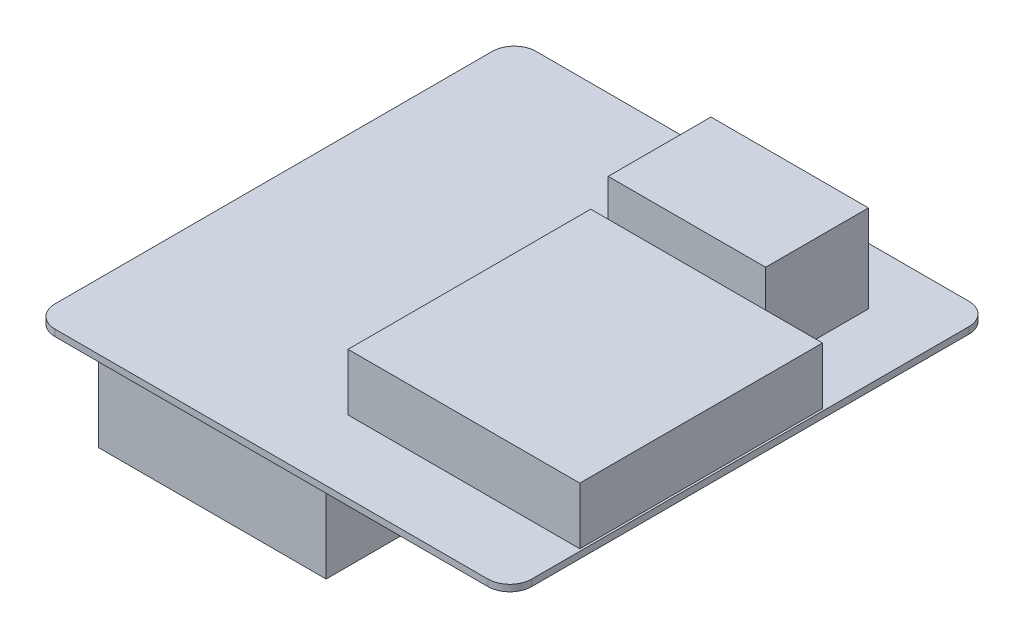
ISO-10303-21;
HEADER;
FILE_DESCRIPTION(('STEP AP214'),'2;1');
FILE_NAME('part.step','',(''),(''),'','','');
FILE_SCHEMA(('AUTOMOTIVE_DESIGN { 1 0 10303 214 1 1 1 1 }'));
ENDSEC;
DATA;
#1=APPLICATION_CONTEXT('core data for automotive mechanical design processes');
#2=APPLICATION_PROTOCOL_DEFINITION('international standard','automotive_design',2000,#1);
#3=PRODUCT_CONTEXT('',#1,'mechanical');
#4=PRODUCT('Part','Part','',(#3));
#5=PRODUCT_RELATED_PRODUCT_CATEGORY('part','',(#4));
#6=PRODUCT_DEFINITION_FORMATION('','',#4);
#7=PRODUCT_DEFINITION_CONTEXT('part definition',#1,'design');
#8=PRODUCT_DEFINITION('design','',#6,#7);
#9=PRODUCT_DEFINITION_SHAPE('','',#8);
#10=(LENGTH_UNIT() NAMED_UNIT(*) SI_UNIT(.MILLI.,.METRE.));
#11=(NAMED_UNIT(*) PLANE_ANGLE_UNIT() SI_UNIT($,.RADIAN.));
#12=(NAMED_UNIT(*) SI_UNIT($,.STERADIAN.) SOLID_ANGLE_UNIT());
#13=UNCERTAINTY_MEASURE_WITH_UNIT(LENGTH_MEASURE(1.E-05),#10,'distance_accuracy_value','');
#14=(GEOMETRIC_REPRESENTATION_CONTEXT(3) GLOBAL_UNCERTAINTY_ASSIGNED_CONTEXT((#13)) GLOBAL_UNIT_ASSIGNED_CONTEXT((#10,
#11,#12)) REPRESENTATION_CONTEXT('',''));
#15=CARTESIAN_POINT('',(0.,0.,0.));
#16=DIRECTION('',(0.,0.,1.));
#17=DIRECTION('',(1.,0.,0.));
#18=AXIS2_PLACEMENT_3D('',#15,#16,#17);
#19=CARTESIAN_POINT('',(0.,1.5,0.));
#20=DIRECTION('',(0.,-1.,0.));
#21=DIRECTION('',(0.,0.,-1.));
#22=AXIS2_PLACEMENT_3D('',#19,#20,#21);
#23=PLANE('',#22);
#24=DIRECTION('',(0.,0.,1.));
#25=VECTOR('',#24,1.);
#26=CARTESIAN_POINT('',(55.5,1.5,-16.5));
#27=LINE('',#26,#25);
#28=CARTESIAN_POINT('',(55.5,1.5,-72.));
#29=VERTEX_POINT('',#28);
#30=CARTESIAN_POINT('',(55.5,1.5,-16.5));
#31=VERTEX_POINT('',#30);
#32=EDGE_CURVE('E193',#29,#31,#27,.T.);
#33=ORIENTED_EDGE('',*,*,#32,.F.);
#34=DIRECTION('',(-1.,0.,0.));
#35=VECTOR('',#34,1.);
#36=CARTESIAN_POINT('',(55.5,1.5,-72.));
#37=LINE('',#36,#35);
#38=CARTESIAN_POINT('',(108.5,1.5,-72.));
#39=VERTEX_POINT('',#38);
#40=EDGE_CURVE('E206',#39,#29,#37,.T.);
#41=ORIENTED_EDGE('',*,*,#40,.F.);
#42=DIRECTION('',(0.,0.,-1.));
#43=VECTOR('',#42,1.);
#44=CARTESIAN_POINT('',(108.5,1.5,-16.5));
#45=LINE('',#44,#43);
#46=CARTESIAN_POINT('',(108.5,1.5,-16.5));
#47=VERTEX_POINT('',#46);
#48=EDGE_CURVE('E215',#47,#39,#45,.T.);
#49=ORIENTED_EDGE('',*,*,#48,.F.);
#50=DIRECTION('',(1.,0.,0.));
#51=VECTOR('',#50,1.);
#52=CARTESIAN_POINT('',(55.5,1.5,-16.5));
#53=LINE('',#52,#51);
#54=EDGE_CURVE('E196',#31,#47,#53,.T.);
#55=ORIENTED_EDGE('',*,*,#54,.F.);
#56=EDGE_LOOP('',(#33,#41,#49,#55));
#57=FACE_BOUND('',#56,.T.);
#58=DIRECTION('',(1.,0.,0.));
#59=VECTOR('',#58,1.);
#60=CARTESIAN_POINT('',(0.,1.5,0.));
#61=LINE('',#60,#59);
#62=CARTESIAN_POINT('',(5.,1.5,0.));
#63=VERTEX_POINT('',#62);
#64=CARTESIAN_POINT('',(104.,1.5,0.));
#65=VERTEX_POINT('',#64);
#66=EDGE_CURVE('E264',#63,#65,#61,.T.);
#67=ORIENTED_EDGE('',*,*,#66,.T.);
#68=CARTESIAN_POINT('',(104.,1.5,-5.));
#69=DIRECTION('',(0.,-1.,0.));
#70=DIRECTION('',(0.,0.,-1.));
#71=AXIS2_PLACEMENT_3D('',#68,#69,#70);
#72=CIRCLE('',#71,5.);
#73=CARTESIAN_POINT('',(109.,1.5,-5.));
#74=VERTEX_POINT('',#73);
#75=EDGE_CURVE('E308',#65,#74,#72,.F.);
#76=ORIENTED_EDGE('',*,*,#75,.T.);
#77=DIRECTION('',(0.,0.,-1.));
#78=VECTOR('',#77,1.);
#79=CARTESIAN_POINT('',(109.,1.5,0.));
#80=LINE('',#79,#78);
#81=CARTESIAN_POINT('',(109.,1.5,-105.));
#82=VERTEX_POINT('',#81);
#83=EDGE_CURVE('E268',#74,#82,#80,.T.);
#84=ORIENTED_EDGE('',*,*,#83,.T.);
#85=CARTESIAN_POINT('',(104.,1.5,-105.));
#86=DIRECTION('',(0.,-1.,0.));
#87=DIRECTION('',(0.,0.,-1.));
#88=AXIS2_PLACEMENT_3D('',#85,#86,#87);
#89=CIRCLE('',#88,5.);
#90=CARTESIAN_POINT('',(104.,1.5,-110.));
#91=VERTEX_POINT('',#90);
#92=EDGE_CURVE('E306',#82,#91,#89,.F.);
#93=ORIENTED_EDGE('',*,*,#92,.T.);
#94=DIRECTION('',(-1.,0.,0.));
#95=VECTOR('',#94,1.);
#96=CARTESIAN_POINT('',(0.,1.5,-110.));
#97=LINE('',#96,#95);
#98=CARTESIAN_POINT('',(5.,1.5,-110.));
#99=VERTEX_POINT('',#98);
#100=EDGE_CURVE('E271',#91,#99,#97,.T.);
#101=ORIENTED_EDGE('',*,*,#100,.T.);
#102=CARTESIAN_POINT('',(5.,1.5,-105.));
#103=DIRECTION('',(0.,-1.,0.));
#104=DIRECTION('',(0.,0.,-1.));
#105=AXIS2_PLACEMENT_3D('',#102,#103,#104);
#106=CIRCLE('',#105,5.);
#107=CARTESIAN_POINT('',(0.,1.5,-105.));
#108=VERTEX_POINT('',#107);
#109=EDGE_CURVE('E304',#99,#108,#106,.F.);
#110=ORIENTED_EDGE('',*,*,#109,.T.);
#111=DIRECTION('',(0.,0.,1.));
#112=VECTOR('',#111,1.);
#113=CARTESIAN_POINT('',(0.,1.5,0.));
#114=LINE('',#113,#112);
#115=CARTESIAN_POINT('',(0.,1.5,-5.));
#116=VERTEX_POINT('',#115);
#117=EDGE_CURVE('E261',#108,#116,#114,.T.);
#118=ORIENTED_EDGE('',*,*,#117,.T.);
#119=CARTESIAN_POINT('',(5.,1.5,-5.));
#120=DIRECTION('',(0.,-1.,0.));
#121=DIRECTION('',(0.,0.,-1.));
#122=AXIS2_PLACEMENT_3D('',#119,#120,#121);
#123=CIRCLE('',#122,5.);
#124=EDGE_CURVE('E302',#116,#63,#123,.F.);
#125=ORIENTED_EDGE('',*,*,#124,.T.);
#126=EDGE_LOOP('',(#67,#76,#84,#93,#101,#110,#118,#125));
#127=FACE_BOUND('',#126,.T.);
#128=DIRECTION('',(0.,0.,1.));
#129=VECTOR('',#128,1.);
#130=CARTESIAN_POINT('',(58.,1.5,-73.5));
#131=LINE('',#130,#129);
#132=CARTESIAN_POINT('',(58.,1.5,-97.));
#133=VERTEX_POINT('',#132);
#134=CARTESIAN_POINT('',(58.,1.5,-73.5));
#135=VERTEX_POINT('',#134);
#136=EDGE_CURVE('E192',#133,#135,#131,.T.);
#137=ORIENTED_EDGE('',*,*,#136,.F.);
#138=DIRECTION('',(-1.,0.,0.));
#139=VECTOR('',#138,1.);
#140=CARTESIAN_POINT('',(58.,1.5,-97.));
#141=LINE('',#140,#139);
#142=CARTESIAN_POINT('',(94.,1.5,-97.));
#143=VERTEX_POINT('',#142);
#144=EDGE_CURVE('E189',#143,#133,#141,.T.);
#145=ORIENTED_EDGE('',*,*,#144,.F.);
#146=DIRECTION('',(0.,0.,-1.));
#147=VECTOR('',#146,1.);
#148=CARTESIAN_POINT('',(94.,1.5,-73.5));
#149=LINE('',#148,#147);
#150=CARTESIAN_POINT('',(94.,1.5,-73.5));
#151=VERTEX_POINT('',#150);
#152=EDGE_CURVE('E55',#151,#143,#149,.T.);
#153=ORIENTED_EDGE('',*,*,#152,.F.);
#154=DIRECTION('',(1.,0.,0.));
#155=VECTOR('',#154,1.);
#156=CARTESIAN_POINT('',(58.,1.5,-73.5));
#157=LINE('',#156,#155);
#158=EDGE_CURVE('E50',#135,#151,#157,.T.);
#159=ORIENTED_EDGE('',*,*,#158,.F.);
#160=EDGE_LOOP('',(#137,#145,#153,#159));
#161=FACE_BOUND('',#160,.T.);
#162=ADVANCED_FACE('F35',(#57,#127,#161),#23,.F.);
#163=CARTESIAN_POINT('',(0.,0.,0.));
#164=DIRECTION('',(0.,-1.,0.));
#165=DIRECTION('',(0.,0.,-1.));
#166=AXIS2_PLACEMENT_3D('',#163,#164,#165);
#167=PLANE('',#166);
#168=DIRECTION('',(0.,0.,-1.));
#169=VECTOR('',#168,1.);
#170=CARTESIAN_POINT('',(109.,0.,0.));
#171=LINE('',#170,#169);
#172=CARTESIAN_POINT('',(109.,0.,-5.));
#173=VERTEX_POINT('',#172);
#174=CARTESIAN_POINT('',(109.,0.,-105.));
#175=VERTEX_POINT('',#174);
#176=EDGE_CURVE('E280',#173,#175,#171,.T.);
#177=ORIENTED_EDGE('',*,*,#176,.F.);
#178=CARTESIAN_POINT('',(104.,0.,-5.));
#179=DIRECTION('',(0.,-1.,0.));
#180=DIRECTION('',(0.,0.,-1.));
#181=AXIS2_PLACEMENT_3D('',#178,#179,#180);
#182=CIRCLE('',#181,5.);
#183=CARTESIAN_POINT('',(104.,0.,0.));
#184=VERTEX_POINT('',#183);
#185=EDGE_CURVE('E295',#173,#184,#182,.T.);
#186=ORIENTED_EDGE('',*,*,#185,.T.);
#187=DIRECTION('',(1.,0.,0.));
#188=VECTOR('',#187,1.);
#189=CARTESIAN_POINT('',(0.,0.,0.));
#190=LINE('',#189,#188);
#191=CARTESIAN_POINT('',(5.,0.,0.));
#192=VERTEX_POINT('',#191);
#193=EDGE_CURVE('E277',#192,#184,#190,.T.);
#194=ORIENTED_EDGE('',*,*,#193,.F.);
#195=CARTESIAN_POINT('',(5.,0.,-5.));
#196=DIRECTION('',(0.,-1.,0.));
#197=DIRECTION('',(0.,0.,-1.));
#198=AXIS2_PLACEMENT_3D('',#195,#196,#197);
#199=CIRCLE('',#198,5.);
#200=CARTESIAN_POINT('',(0.,0.,-5.));
#201=VERTEX_POINT('',#200);
#202=EDGE_CURVE('E289',#192,#201,#199,.T.);
#203=ORIENTED_EDGE('',*,*,#202,.T.);
#204=DIRECTION('',(0.,0.,1.));
#205=VECTOR('',#204,1.);
#206=CARTESIAN_POINT('',(0.,0.,0.));
#207=LINE('',#206,#205);
#208=CARTESIAN_POINT('',(0.,0.,-105.));
#209=VERTEX_POINT('',#208);
#210=EDGE_CURVE('E260',#209,#201,#207,.T.);
#211=ORIENTED_EDGE('',*,*,#210,.F.);
#212=CARTESIAN_POINT('',(5.,0.,-105.));
#213=DIRECTION('',(0.,-1.,0.));
#214=DIRECTION('',(0.,0.,-1.));
#215=AXIS2_PLACEMENT_3D('',#212,#213,#214);
#216=CIRCLE('',#215,5.);
#217=CARTESIAN_POINT('',(5.,0.,-110.));
#218=VERTEX_POINT('',#217);
#219=EDGE_CURVE('E291',#209,#218,#216,.T.);
#220=ORIENTED_EDGE('',*,*,#219,.T.);
#221=DIRECTION('',(-1.,0.,0.));
#222=VECTOR('',#221,1.);
#223=CARTESIAN_POINT('',(0.,0.,-110.));
#224=LINE('',#223,#222);
#225=CARTESIAN_POINT('',(104.,0.,-110.));
#226=VERTEX_POINT('',#225);
#227=EDGE_CURVE('E265',#226,#218,#224,.T.);
#228=ORIENTED_EDGE('',*,*,#227,.F.);
#229=CARTESIAN_POINT('',(104.,0.,-105.));
#230=DIRECTION('',(0.,-1.,0.));
#231=DIRECTION('',(0.,0.,-1.));
#232=AXIS2_PLACEMENT_3D('',#229,#230,#231);
#233=CIRCLE('',#232,5.);
#234=EDGE_CURVE('E293',#226,#175,#233,.T.);
#235=ORIENTED_EDGE('',*,*,#234,.T.);
#236=EDGE_LOOP('',(#177,#186,#194,#203,#211,#220,#228,#235));
#237=FACE_BOUND('',#236,.T.);
#238=DIRECTION('',(1.,0.,0.));
#239=VECTOR('',#238,1.);
#240=CARTESIAN_POINT('',(3.00000000000001,0.,-97.5));
#241=LINE('',#240,#239);
#242=CARTESIAN_POINT('',(3.00000000000001,0.,-97.5));
#243=VERTEX_POINT('',#242);
#244=CARTESIAN_POINT('',(55.,0.,-97.5));
#245=VERTEX_POINT('',#244);
#246=EDGE_CURVE('E245',#243,#245,#241,.T.);
#247=ORIENTED_EDGE('',*,*,#246,.F.);
#248=DIRECTION('',(0.,0.,-1.));
#249=VECTOR('',#248,1.);
#250=CARTESIAN_POINT('',(3.,0.,-12.));
#251=LINE('',#250,#249);
#252=CARTESIAN_POINT('',(3.,0.,-12.));
#253=VERTEX_POINT('',#252);
#254=EDGE_CURVE('E231',#253,#243,#251,.T.);
#255=ORIENTED_EDGE('',*,*,#254,.F.);
#256=DIRECTION('',(-1.,0.,0.));
#257=VECTOR('',#256,1.);
#258=CARTESIAN_POINT('',(3.,0.,-12.));
#259=LINE('',#258,#257);
#260=CARTESIAN_POINT('',(55.,0.,-12.));
#261=VERTEX_POINT('',#260);
#262=EDGE_CURVE('E236',#261,#253,#259,.T.);
#263=ORIENTED_EDGE('',*,*,#262,.F.);
#264=DIRECTION('',(0.,0.,1.));
#265=VECTOR('',#264,1.);
#266=CARTESIAN_POINT('',(55.,0.,-12.));
#267=LINE('',#266,#265);
#268=EDGE_CURVE('E247',#245,#261,#267,.T.);
#269=ORIENTED_EDGE('',*,*,#268,.F.);
#270=EDGE_LOOP('',(#247,#255,#263,#269));
#271=FACE_BOUND('',#270,.T.);
#272=ADVANCED_FACE('F332',(#237,#271),#167,.T.);
#273=CARTESIAN_POINT('',(0.,1.5,0.));
#274=DIRECTION('',(1.,0.,0.));
#275=DIRECTION('',(0.,0.,-1.));
#276=AXIS2_PLACEMENT_3D('',#273,#274,#275);
#277=PLANE('',#276);
#278=ORIENTED_EDGE('',*,*,#117,.F.);
#279=DIRECTION('',(0.,-1.,0.));
#280=VECTOR('',#279,1.);
#281=CARTESIAN_POINT('',(0.,1.5,-105.));
#282=LINE('',#281,#280);
#283=EDGE_CURVE('E11',#108,#209,#282,.T.);
#284=ORIENTED_EDGE('',*,*,#283,.T.);
#285=ORIENTED_EDGE('',*,*,#210,.T.);
#286=DIRECTION('',(0.,-1.,0.));
#287=VECTOR('',#286,1.);
#288=CARTESIAN_POINT('',(0.,1.5,-5.));
#289=LINE('',#288,#287);
#290=EDGE_CURVE('E43',#201,#116,#289,.F.);
#291=ORIENTED_EDGE('',*,*,#290,.T.);
#292=EDGE_LOOP('',(#278,#284,#285,#291));
#293=FACE_BOUND('',#292,.T.);
#294=ADVANCED_FACE('F317',(#293),#277,.F.);
#295=CARTESIAN_POINT('',(0.,1.5,0.));
#296=DIRECTION('',(0.,0.,-1.));
#297=DIRECTION('',(-1.,0.,0.));
#298=AXIS2_PLACEMENT_3D('',#295,#296,#297);
#299=PLANE('',#298);
#300=ORIENTED_EDGE('',*,*,#193,.T.);
#301=DIRECTION('',(0.,-1.,0.));
#302=VECTOR('',#301,1.);
#303=CARTESIAN_POINT('',(104.,1.5,0.));
#304=LINE('',#303,#302);
#305=EDGE_CURVE('E300',#184,#65,#304,.F.);
#306=ORIENTED_EDGE('',*,*,#305,.T.);
#307=ORIENTED_EDGE('',*,*,#66,.F.);
#308=DIRECTION('',(0.,-1.,0.));
#309=VECTOR('',#308,1.);
#310=CARTESIAN_POINT('',(5.,1.5,0.));
#311=LINE('',#310,#309);
#312=EDGE_CURVE('E297',#63,#192,#311,.T.);
#313=ORIENTED_EDGE('',*,*,#312,.T.);
#314=EDGE_LOOP('',(#300,#306,#307,#313));
#315=FACE_BOUND('',#314,.T.);
#316=ADVANCED_FACE('F328',(#315),#299,.F.);
#317=CARTESIAN_POINT('',(109.,1.5,0.));
#318=DIRECTION('',(-1.,0.,0.));
#319=DIRECTION('',(0.,0.,1.));
#320=AXIS2_PLACEMENT_3D('',#317,#318,#319);
#321=PLANE('',#320);
#322=ORIENTED_EDGE('',*,*,#83,.F.);
#323=DIRECTION('',(0.,-1.,0.));
#324=VECTOR('',#323,1.);
#325=CARTESIAN_POINT('',(109.,1.5,-5.));
#326=LINE('',#325,#324);
#327=EDGE_CURVE('E286',#74,#173,#326,.T.);
#328=ORIENTED_EDGE('',*,*,#327,.T.);
#329=ORIENTED_EDGE('',*,*,#176,.T.);
#330=DIRECTION('',(0.,-1.,0.));
#331=VECTOR('',#330,1.);
#332=CARTESIAN_POINT('',(109.,1.5,-105.));
#333=LINE('',#332,#331);
#334=EDGE_CURVE('E274',#175,#82,#333,.F.);
#335=ORIENTED_EDGE('',*,*,#334,.T.);
#336=EDGE_LOOP('',(#322,#328,#329,#335));
#337=FACE_BOUND('',#336,.T.);
#338=ADVANCED_FACE('F340',(#337),#321,.F.);
#339=CARTESIAN_POINT('',(0.,1.5,-110.));
#340=DIRECTION('',(0.,0.,1.));
#341=DIRECTION('',(1.,0.,0.));
#342=AXIS2_PLACEMENT_3D('',#339,#340,#341);
#343=PLANE('',#342);
#344=ORIENTED_EDGE('',*,*,#100,.F.);
#345=DIRECTION('',(0.,-1.,0.));
#346=VECTOR('',#345,1.);
#347=CARTESIAN_POINT('',(104.,1.5,-110.));
#348=LINE('',#347,#346);
#349=EDGE_CURVE('E312',#91,#226,#348,.T.);
#350=ORIENTED_EDGE('',*,*,#349,.T.);
#351=ORIENTED_EDGE('',*,*,#227,.T.);
#352=DIRECTION('',(0.,-1.,0.));
#353=VECTOR('',#352,1.);
#354=CARTESIAN_POINT('',(5.,1.5,-110.));
#355=LINE('',#354,#353);
#356=EDGE_CURVE('E310',#218,#99,#355,.F.);
#357=ORIENTED_EDGE('',*,*,#356,.T.);
#358=EDGE_LOOP('',(#344,#350,#351,#357));
#359=FACE_BOUND('',#358,.T.);
#360=ADVANCED_FACE('F349',(#359),#343,.F.);
#361=CARTESIAN_POINT('',(104.,1.5,-5.));
#362=DIRECTION('',(0.,-1.,0.));
#363=DIRECTION('',(0.,0.,-1.));
#364=AXIS2_PLACEMENT_3D('',#361,#362,#363);
#365=CYLINDRICAL_SURFACE('',#364,5.);
#366=ORIENTED_EDGE('',*,*,#75,.F.);
#367=ORIENTED_EDGE('',*,*,#305,.F.);
#368=ORIENTED_EDGE('',*,*,#185,.F.);
#369=ORIENTED_EDGE('',*,*,#327,.F.);
#370=EDGE_LOOP('',(#366,#367,#368,#369));
#371=FACE_BOUND('',#370,.T.);
#372=ADVANCED_FACE('F337',(#371),#365,.T.);
#373=CARTESIAN_POINT('',(104.,1.5,-105.));
#374=DIRECTION('',(0.,-1.,0.));
#375=DIRECTION('',(0.,0.,-1.));
#376=AXIS2_PLACEMENT_3D('',#373,#374,#375);
#377=CYLINDRICAL_SURFACE('',#376,5.);
#378=ORIENTED_EDGE('',*,*,#92,.F.);
#379=ORIENTED_EDGE('',*,*,#334,.F.);
#380=ORIENTED_EDGE('',*,*,#234,.F.);
#381=ORIENTED_EDGE('',*,*,#349,.F.);
#382=EDGE_LOOP('',(#378,#379,#380,#381));
#383=FACE_BOUND('',#382,.T.);
#384=ADVANCED_FACE('F346',(#383),#377,.T.);
#385=CARTESIAN_POINT('',(5.,1.5,-105.));
#386=DIRECTION('',(0.,-1.,0.));
#387=DIRECTION('',(0.,0.,-1.));
#388=AXIS2_PLACEMENT_3D('',#385,#386,#387);
#389=CYLINDRICAL_SURFACE('',#388,5.);
#390=ORIENTED_EDGE('',*,*,#109,.F.);
#391=ORIENTED_EDGE('',*,*,#356,.F.);
#392=ORIENTED_EDGE('',*,*,#219,.F.);
#393=ORIENTED_EDGE('',*,*,#283,.F.);
#394=EDGE_LOOP('',(#390,#391,#392,#393));
#395=FACE_BOUND('',#394,.T.);
#396=ADVANCED_FACE('F352',(#395),#389,.T.);
#397=CARTESIAN_POINT('',(5.,1.5,-5.));
#398=DIRECTION('',(0.,-1.,0.));
#399=DIRECTION('',(0.,0.,-1.));
#400=AXIS2_PLACEMENT_3D('',#397,#398,#399);
#401=CYLINDRICAL_SURFACE('',#400,5.);
#402=ORIENTED_EDGE('',*,*,#124,.F.);
#403=ORIENTED_EDGE('',*,*,#290,.F.);
#404=ORIENTED_EDGE('',*,*,#202,.F.);
#405=ORIENTED_EDGE('',*,*,#312,.F.);
#406=EDGE_LOOP('',(#402,#403,#404,#405));
#407=FACE_BOUND('',#406,.T.);
#408=ADVANCED_FACE('F37',(#407),#401,.T.);
#409=CARTESIAN_POINT('',(3.,-29.,-12.));
#410=DIRECTION('',(1.,0.,0.));
#411=DIRECTION('',(0.,0.,-1.));
#412=AXIS2_PLACEMENT_3D('',#409,#410,#411);
#413=PLANE('',#412);
#414=ORIENTED_EDGE('',*,*,#254,.T.);
#415=DIRECTION('',(0.,1.,0.));
#416=VECTOR('',#415,1.);
#417=CARTESIAN_POINT('',(3.00000000000001,-29.,-97.5));
#418=LINE('',#417,#416);
#419=CARTESIAN_POINT('',(3.00000000000001,-29.,-97.5));
#420=VERTEX_POINT('',#419);
#421=EDGE_CURVE('E258',#420,#243,#418,.T.);
#422=ORIENTED_EDGE('',*,*,#421,.F.);
#423=DIRECTION('',(0.,0.,-1.));
#424=VECTOR('',#423,1.);
#425=CARTESIAN_POINT('',(3.,-29.,-12.));
#426=LINE('',#425,#424);
#427=CARTESIAN_POINT('',(3.,-29.,-12.));
#428=VERTEX_POINT('',#427);
#429=EDGE_CURVE('E232',#428,#420,#426,.T.);
#430=ORIENTED_EDGE('',*,*,#429,.F.);
#431=DIRECTION('',(0.,1.,0.));
#432=VECTOR('',#431,1.);
#433=CARTESIAN_POINT('',(3.,-29.,-12.));
#434=LINE('',#433,#432);
#435=EDGE_CURVE('E242',#428,#253,#434,.T.);
#436=ORIENTED_EDGE('',*,*,#435,.T.);
#437=EDGE_LOOP('',(#414,#422,#430,#436));
#438=FACE_BOUND('',#437,.T.);
#439=ADVANCED_FACE('F358',(#438),#413,.F.);
#440=CARTESIAN_POINT('',(3.00000000000001,-29.,-97.5));
#441=DIRECTION('',(0.,0.,1.));
#442=DIRECTION('',(1.,0.,0.));
#443=AXIS2_PLACEMENT_3D('',#440,#441,#442);
#444=PLANE('',#443);
#445=ORIENTED_EDGE('',*,*,#246,.T.);
#446=DIRECTION('',(0.,1.,0.));
#447=VECTOR('',#446,1.);
#448=CARTESIAN_POINT('',(55.,-29.,-97.5));
#449=LINE('',#448,#447);
#450=CARTESIAN_POINT('',(55.,-29.,-97.5));
#451=VERTEX_POINT('',#450);
#452=EDGE_CURVE('E255',#451,#245,#449,.T.);
#453=ORIENTED_EDGE('',*,*,#452,.F.);
#454=DIRECTION('',(1.,0.,0.));
#455=VECTOR('',#454,1.);
#456=CARTESIAN_POINT('',(3.00000000000001,-29.,-97.5));
#457=LINE('',#456,#455);
#458=EDGE_CURVE('E235',#420,#451,#457,.T.);
#459=ORIENTED_EDGE('',*,*,#458,.F.);
#460=ORIENTED_EDGE('',*,*,#421,.T.);
#461=EDGE_LOOP('',(#445,#453,#459,#460));
#462=FACE_BOUND('',#461,.T.);
#463=ADVANCED_FACE('F413',(#462),#444,.F.);
#464=CARTESIAN_POINT('',(55.,-29.,-12.));
#465=DIRECTION('',(-1.,0.,0.));
#466=DIRECTION('',(0.,0.,1.));
#467=AXIS2_PLACEMENT_3D('',#464,#465,#466);
#468=PLANE('',#467);
#469=ORIENTED_EDGE('',*,*,#268,.T.);
#470=DIRECTION('',(0.,1.,0.));
#471=VECTOR('',#470,1.);
#472=CARTESIAN_POINT('',(55.,-29.,-12.));
#473=LINE('',#472,#471);
#474=CARTESIAN_POINT('',(55.,-29.,-12.));
#475=VERTEX_POINT('',#474);
#476=EDGE_CURVE('E253',#475,#261,#473,.T.);
#477=ORIENTED_EDGE('',*,*,#476,.F.);
#478=DIRECTION('',(0.,0.,1.));
#479=VECTOR('',#478,1.);
#480=CARTESIAN_POINT('',(55.,-29.,-12.));
#481=LINE('',#480,#479);
#482=EDGE_CURVE('E238',#451,#475,#481,.T.);
#483=ORIENTED_EDGE('',*,*,#482,.F.);
#484=ORIENTED_EDGE('',*,*,#452,.T.);
#485=EDGE_LOOP('',(#469,#477,#483,#484));
#486=FACE_BOUND('',#485,.T.);
#487=ADVANCED_FACE('F425',(#486),#468,.F.);
#488=CARTESIAN_POINT('',(3.,-29.,-12.));
#489=DIRECTION('',(0.,0.,-1.));
#490=DIRECTION('',(-1.,0.,0.));
#491=AXIS2_PLACEMENT_3D('',#488,#489,#490);
#492=PLANE('',#491);
#493=ORIENTED_EDGE('',*,*,#262,.T.);
#494=ORIENTED_EDGE('',*,*,#435,.F.);
#495=DIRECTION('',(-1.,0.,0.));
#496=VECTOR('',#495,1.);
#497=CARTESIAN_POINT('',(3.,-29.,-12.));
#498=LINE('',#497,#496);
#499=EDGE_CURVE('E240',#475,#428,#498,.T.);
#500=ORIENTED_EDGE('',*,*,#499,.F.);
#501=ORIENTED_EDGE('',*,*,#476,.T.);
#502=EDGE_LOOP('',(#493,#494,#500,#501));
#503=FACE_BOUND('',#502,.T.);
#504=ADVANCED_FACE('F436',(#503),#492,.F.);
#505=CARTESIAN_POINT('',(0.,-29.,0.));
#506=DIRECTION('',(0.,-1.,0.));
#507=DIRECTION('',(0.,0.,-1.));
#508=AXIS2_PLACEMENT_3D('',#505,#506,#507);
#509=PLANE('',#508);
#510=ORIENTED_EDGE('',*,*,#429,.T.);
#511=ORIENTED_EDGE('',*,*,#458,.T.);
#512=ORIENTED_EDGE('',*,*,#482,.T.);
#513=ORIENTED_EDGE('',*,*,#499,.T.);
#514=EDGE_LOOP('',(#510,#511,#512,#513));
#515=FACE_BOUND('',#514,.T.);
#516=ADVANCED_FACE('F446',(#515),#509,.T.);
#517=CARTESIAN_POINT('',(0.,14.5,0.));
#518=DIRECTION('',(0.,-1.,0.));
#519=DIRECTION('',(0.,0.,-1.));
#520=AXIS2_PLACEMENT_3D('',#517,#518,#519);
#521=PLANE('',#520);
#522=DIRECTION('',(0.,0.,1.));
#523=VECTOR('',#522,1.);
#524=CARTESIAN_POINT('',(55.5,14.5,-16.5));
#525=LINE('',#524,#523);
#526=CARTESIAN_POINT('',(55.5,14.5,-72.));
#527=VERTEX_POINT('',#526);
#528=CARTESIAN_POINT('',(55.5,14.5,-16.5));
#529=VERTEX_POINT('',#528);
#530=EDGE_CURVE('E202',#527,#529,#525,.T.);
#531=ORIENTED_EDGE('',*,*,#530,.T.);
#532=DIRECTION('',(1.,0.,0.));
#533=VECTOR('',#532,1.);
#534=CARTESIAN_POINT('',(55.5,14.5,-16.5));
#535=LINE('',#534,#533);
#536=CARTESIAN_POINT('',(108.5,14.5,-16.5));
#537=VERTEX_POINT('',#536);
#538=EDGE_CURVE('E205',#529,#537,#535,.T.);
#539=ORIENTED_EDGE('',*,*,#538,.T.);
#540=DIRECTION('',(0.,0.,-1.));
#541=VECTOR('',#540,1.);
#542=CARTESIAN_POINT('',(108.5,14.5,-16.5));
#543=LINE('',#542,#541);
#544=CARTESIAN_POINT('',(108.5,14.5,-72.));
#545=VERTEX_POINT('',#544);
#546=EDGE_CURVE('E208',#537,#545,#543,.T.);
#547=ORIENTED_EDGE('',*,*,#546,.T.);
#548=DIRECTION('',(-1.,0.,0.));
#549=VECTOR('',#548,1.);
#550=CARTESIAN_POINT('',(55.5,14.5,-72.));
#551=LINE('',#550,#549);
#552=EDGE_CURVE('E210',#545,#527,#551,.T.);
#553=ORIENTED_EDGE('',*,*,#552,.T.);
#554=EDGE_LOOP('',(#531,#539,#547,#553));
#555=FACE_BOUND('',#554,.T.);
#556=ADVANCED_FACE('F456',(#555),#521,.F.);
#557=CARTESIAN_POINT('',(55.5,14.5,-16.5));
#558=DIRECTION('',(1.,0.,0.));
#559=DIRECTION('',(0.,0.,-1.));
#560=AXIS2_PLACEMENT_3D('',#557,#558,#559);
#561=PLANE('',#560);
#562=ORIENTED_EDGE('',*,*,#32,.T.);
#563=DIRECTION('',(0.,-1.,0.));
#564=VECTOR('',#563,1.);
#565=CARTESIAN_POINT('',(55.5,14.5,-16.5));
#566=LINE('',#565,#564);
#567=EDGE_CURVE('E228',#529,#31,#566,.T.);
#568=ORIENTED_EDGE('',*,*,#567,.F.);
#569=ORIENTED_EDGE('',*,*,#530,.F.);
#570=DIRECTION('',(0.,-1.,0.));
#571=VECTOR('',#570,1.);
#572=CARTESIAN_POINT('',(55.5,14.5,-72.));
#573=LINE('',#572,#571);
#574=EDGE_CURVE('E211',#527,#29,#573,.T.);
#575=ORIENTED_EDGE('',*,*,#574,.T.);
#576=EDGE_LOOP('',(#562,#568,#569,#575));
#577=FACE_BOUND('',#576,.T.);
#578=ADVANCED_FACE('F463',(#577),#561,.F.);
#579=CARTESIAN_POINT('',(55.5,14.5,-16.5));
#580=DIRECTION('',(0.,0.,-1.));
#581=DIRECTION('',(-1.,0.,0.));
#582=AXIS2_PLACEMENT_3D('',#579,#580,#581);
#583=PLANE('',#582);
#584=ORIENTED_EDGE('',*,*,#54,.T.);
#585=DIRECTION('',(0.,-1.,0.));
#586=VECTOR('',#585,1.);
#587=CARTESIAN_POINT('',(108.5,14.5,-16.5));
#588=LINE('',#587,#586);
#589=EDGE_CURVE('E225',#537,#47,#588,.T.);
#590=ORIENTED_EDGE('',*,*,#589,.F.);
#591=ORIENTED_EDGE('',*,*,#538,.F.);
#592=ORIENTED_EDGE('',*,*,#567,.T.);
#593=EDGE_LOOP('',(#584,#590,#591,#592));
#594=FACE_BOUND('',#593,.T.);
#595=ADVANCED_FACE('F469',(#594),#583,.F.);
#596=CARTESIAN_POINT('',(108.5,14.5,-16.5));
#597=DIRECTION('',(-1.,0.,0.));
#598=DIRECTION('',(0.,0.,1.));
#599=AXIS2_PLACEMENT_3D('',#596,#597,#598);
#600=PLANE('',#599);
#601=ORIENTED_EDGE('',*,*,#48,.T.);
#602=DIRECTION('',(0.,-1.,0.));
#603=VECTOR('',#602,1.);
#604=CARTESIAN_POINT('',(108.5,14.5,-72.));
#605=LINE('',#604,#603);
#606=EDGE_CURVE('E222',#545,#39,#605,.T.);
#607=ORIENTED_EDGE('',*,*,#606,.F.);
#608=ORIENTED_EDGE('',*,*,#546,.F.);
#609=ORIENTED_EDGE('',*,*,#589,.T.);
#610=EDGE_LOOP('',(#601,#607,#608,#609));
#611=FACE_BOUND('',#610,.T.);
#612=ADVANCED_FACE('F481',(#611),#600,.F.);
#613=CARTESIAN_POINT('',(55.5,14.5,-72.));
#614=DIRECTION('',(0.,0.,1.));
#615=DIRECTION('',(1.,0.,0.));
#616=AXIS2_PLACEMENT_3D('',#613,#614,#615);
#617=PLANE('',#616);
#618=ORIENTED_EDGE('',*,*,#40,.T.);
#619=ORIENTED_EDGE('',*,*,#574,.F.);
#620=ORIENTED_EDGE('',*,*,#552,.F.);
#621=ORIENTED_EDGE('',*,*,#606,.T.);
#622=EDGE_LOOP('',(#618,#619,#620,#621));
#623=FACE_BOUND('',#622,.T.);
#624=ADVANCED_FACE('F493',(#623),#617,.F.);
#625=CARTESIAN_POINT('',(58.,21.5,-73.5));
#626=DIRECTION('',(1.,0.,0.));
#627=DIRECTION('',(0.,0.,-1.));
#628=AXIS2_PLACEMENT_3D('',#625,#626,#627);
#629=PLANE('',#628);
#630=ORIENTED_EDGE('',*,*,#136,.T.);
#631=DIRECTION('',(0.,-1.,0.));
#632=VECTOR('',#631,1.);
#633=CARTESIAN_POINT('',(58.,21.5,-73.5));
#634=LINE('',#633,#632);
#635=CARTESIAN_POINT('',(58.,21.5,-73.5));
#636=VERTEX_POINT('',#635);
#637=EDGE_CURVE('E173',#636,#135,#634,.T.);
#638=ORIENTED_EDGE('',*,*,#637,.F.);
#639=DIRECTION('',(0.,0.,1.));
#640=VECTOR('',#639,1.);
#641=CARTESIAN_POINT('',(58.,21.5,-73.5));
#642=LINE('',#641,#640);
#643=CARTESIAN_POINT('',(58.,21.5,-97.));
#644=VERTEX_POINT('',#643);
#645=EDGE_CURVE('E180',#644,#636,#642,.T.);
#646=ORIENTED_EDGE('',*,*,#645,.F.);
#647=DIRECTION('',(0.,-1.,0.));
#648=VECTOR('',#647,1.);
#649=CARTESIAN_POINT('',(58.,21.5,-97.));
#650=LINE('',#649,#648);
#651=EDGE_CURVE('E585',#644,#133,#650,.T.);
#652=ORIENTED_EDGE('',*,*,#651,.T.);
#653=EDGE_LOOP('',(#630,#638,#646,#652));
#654=FACE_BOUND('',#653,.T.);
#655=ADVANCED_FACE('F191',(#654),#629,.F.);
#656=CARTESIAN_POINT('',(58.,21.5,-73.5));
#657=DIRECTION('',(0.,0.,-1.));
#658=DIRECTION('',(-1.,0.,0.));
#659=AXIS2_PLACEMENT_3D('',#656,#657,#658);
#660=PLANE('',#659);
#661=ORIENTED_EDGE('',*,*,#158,.T.);
#662=DIRECTION('',(0.,-1.,0.));
#663=VECTOR('',#662,1.);
#664=CARTESIAN_POINT('',(94.,21.5,-73.5));
#665=LINE('',#664,#663);
#666=CARTESIAN_POINT('',(94.,21.5,-73.5));
#667=VERTEX_POINT('',#666);
#668=EDGE_CURVE('E176',#667,#151,#665,.T.);
#669=ORIENTED_EDGE('',*,*,#668,.F.);
#670=DIRECTION('',(1.,0.,0.));
#671=VECTOR('',#670,1.);
#672=CARTESIAN_POINT('',(58.,21.5,-73.5));
#673=LINE('',#672,#671);
#674=EDGE_CURVE('E169',#636,#667,#673,.T.);
#675=ORIENTED_EDGE('',*,*,#674,.F.);
#676=ORIENTED_EDGE('',*,*,#637,.T.);
#677=EDGE_LOOP('',(#661,#669,#675,#676));
#678=FACE_BOUND('',#677,.T.);
#679=ADVANCED_FACE('F171',(#678),#660,.F.);
#680=CARTESIAN_POINT('',(94.,21.5,-73.5));
#681=DIRECTION('',(-1.,0.,0.));
#682=DIRECTION('',(0.,0.,1.));
#683=AXIS2_PLACEMENT_3D('',#680,#681,#682);
#684=PLANE('',#683);
#685=ORIENTED_EDGE('',*,*,#152,.T.);
#686=DIRECTION('',(0.,-1.,0.));
#687=VECTOR('',#686,1.);
#688=CARTESIAN_POINT('',(94.,21.5,-97.));
#689=LINE('',#688,#687);
#690=CARTESIAN_POINT('',(94.,21.5,-97.));
#691=VERTEX_POINT('',#690);
#692=EDGE_CURVE('E198',#691,#143,#689,.T.);
#693=ORIENTED_EDGE('',*,*,#692,.F.);
#694=DIRECTION('',(0.,0.,-1.));
#695=VECTOR('',#694,1.);
#696=CARTESIAN_POINT('',(94.,21.5,-73.5));
#697=LINE('',#696,#695);
#698=EDGE_CURVE('E179',#667,#691,#697,.T.);
#699=ORIENTED_EDGE('',*,*,#698,.F.);
#700=ORIENTED_EDGE('',*,*,#668,.T.);
#701=EDGE_LOOP('',(#685,#693,#699,#700));
#702=FACE_BOUND('',#701,.T.);
#703=ADVANCED_FACE('F536',(#702),#684,.F.);
#704=CARTESIAN_POINT('',(58.,21.5,-97.));
#705=DIRECTION('',(0.,0.,1.));
#706=DIRECTION('',(1.,0.,0.));
#707=AXIS2_PLACEMENT_3D('',#704,#705,#706);
#708=PLANE('',#707);
#709=ORIENTED_EDGE('',*,*,#144,.T.);
#710=ORIENTED_EDGE('',*,*,#651,.F.);
#711=DIRECTION('',(-1.,0.,0.));
#712=VECTOR('',#711,1.);
#713=CARTESIAN_POINT('',(58.,21.5,-97.));
#714=LINE('',#713,#712);
#715=EDGE_CURVE('E185',#691,#644,#714,.T.);
#716=ORIENTED_EDGE('',*,*,#715,.F.);
#717=ORIENTED_EDGE('',*,*,#692,.T.);
#718=EDGE_LOOP('',(#709,#710,#716,#717));
#719=FACE_BOUND('',#718,.T.);
#720=ADVANCED_FACE('F546',(#719),#708,.F.);
#721=CARTESIAN_POINT('',(0.,21.5,0.));
#722=DIRECTION('',(0.,-1.,0.));
#723=DIRECTION('',(0.,0.,-1.));
#724=AXIS2_PLACEMENT_3D('',#721,#722,#723);
#725=PLANE('',#724);
#726=ORIENTED_EDGE('',*,*,#645,.T.);
#727=ORIENTED_EDGE('',*,*,#674,.T.);
#728=ORIENTED_EDGE('',*,*,#698,.T.);
#729=ORIENTED_EDGE('',*,*,#715,.T.);
#730=EDGE_LOOP('',(#726,#727,#728,#729));
#731=FACE_BOUND('',#730,.T.);
#732=ADVANCED_FACE('F183',(#731),#725,.F.);
#733=CLOSED_SHELL('',(#162,#272,#294,#316,#338,#360,#372,#384,#396,#408,#439,#463,#487,#504,
#516,#556,#578,#595,#612,#624,#655,#679,#703,#720,#732));
#734=MANIFOLD_SOLID_BREP('B2',#733);
#735=ADVANCED_BREP_SHAPE_REPRESENTATION('',(#18,#734),#14);
#736=SHAPE_DEFINITION_REPRESENTATION(#9,#735);
ENDSEC;
END-ISO-10303-21;
